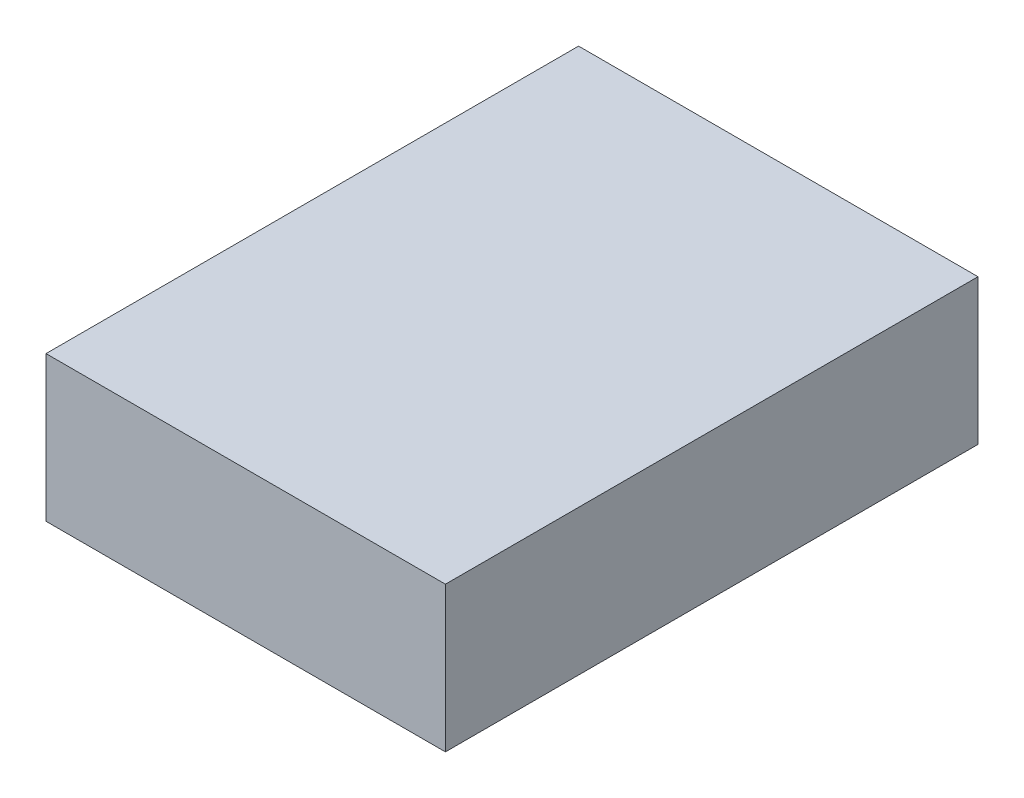
ISO-10303-21;
HEADER;
FILE_DESCRIPTION(('STEP AP214'),'2;1');
FILE_NAME('part.step','',(''),(''),'','','');
FILE_SCHEMA(('AUTOMOTIVE_DESIGN { 1 0 10303 214 1 1 1 1 }'));
ENDSEC;
DATA;
#1=APPLICATION_CONTEXT('core data for automotive mechanical design processes');
#2=APPLICATION_PROTOCOL_DEFINITION('international standard','automotive_design',2000,#1);
#3=PRODUCT_CONTEXT('',#1,'mechanical');
#4=PRODUCT('Part','Part','',(#3));
#5=PRODUCT_RELATED_PRODUCT_CATEGORY('part','',(#4));
#6=PRODUCT_DEFINITION_FORMATION('','',#4);
#7=PRODUCT_DEFINITION_CONTEXT('part definition',#1,'design');
#8=PRODUCT_DEFINITION('design','',#6,#7);
#9=PRODUCT_DEFINITION_SHAPE('','',#8);
#10=(LENGTH_UNIT() NAMED_UNIT(*) SI_UNIT(.MILLI.,.METRE.));
#11=(NAMED_UNIT(*) PLANE_ANGLE_UNIT() SI_UNIT($,.RADIAN.));
#12=(NAMED_UNIT(*) SI_UNIT($,.STERADIAN.) SOLID_ANGLE_UNIT());
#13=UNCERTAINTY_MEASURE_WITH_UNIT(LENGTH_MEASURE(1.E-05),#10,'distance_accuracy_value','');
#14=(GEOMETRIC_REPRESENTATION_CONTEXT(3) GLOBAL_UNCERTAINTY_ASSIGNED_CONTEXT((#13)) GLOBAL_UNIT_ASSIGNED_CONTEXT((#10,
#11,#12)) REPRESENTATION_CONTEXT('',''));
#15=CARTESIAN_POINT('',(0.,0.,0.));
#16=DIRECTION('',(0.,0.,1.));
#17=DIRECTION('',(1.,0.,0.));
#18=AXIS2_PLACEMENT_3D('',#15,#16,#17);
#19=CARTESIAN_POINT('',(0.,19.05,0.));
#20=DIRECTION('',(1.,0.,0.));
#21=DIRECTION('',(0.,0.,-1.));
#22=AXIS2_PLACEMENT_3D('',#19,#20,#21);
#23=PLANE('',#22);
#24=DIRECTION('',(0.,0.,1.));
#25=VECTOR('',#24,1.);
#26=CARTESIAN_POINT('',(0.,0.,0.));
#27=LINE('',#26,#25);
#28=CARTESIAN_POINT('',(0.,0.,-69.85));
#29=VERTEX_POINT('',#28);
#30=CARTESIAN_POINT('',(0.,0.,0.));
#31=VERTEX_POINT('',#30);
#32=EDGE_CURVE('E101',#29,#31,#27,.T.);
#33=ORIENTED_EDGE('',*,*,#32,.T.);
#34=DIRECTION('',(0.,-1.,0.));
#35=VECTOR('',#34,1.);
#36=CARTESIAN_POINT('',(0.,19.05,0.));
#37=LINE('',#36,#35);
#38=CARTESIAN_POINT('',(0.,19.05,0.));
#39=VERTEX_POINT('',#38);
#40=EDGE_CURVE('E11',#39,#31,#37,.T.);
#41=ORIENTED_EDGE('',*,*,#40,.F.);
#42=DIRECTION('',(0.,0.,1.));
#43=VECTOR('',#42,1.);
#44=CARTESIAN_POINT('',(0.,19.05,0.));
#45=LINE('',#44,#43);
#46=CARTESIAN_POINT('',(0.,19.05,-69.85));
#47=VERTEX_POINT('',#46);
#48=EDGE_CURVE('E89',#47,#39,#45,.T.);
#49=ORIENTED_EDGE('',*,*,#48,.F.);
#50=DIRECTION('',(0.,-1.,0.));
#51=VECTOR('',#50,1.);
#52=CARTESIAN_POINT('',(0.,19.05,-69.85));
#53=LINE('',#52,#51);
#54=EDGE_CURVE('E97',#47,#29,#53,.T.);
#55=ORIENTED_EDGE('',*,*,#54,.T.);
#56=EDGE_LOOP('',(#33,#41,#49,#55));
#57=FACE_BOUND('',#56,.T.);
#58=ADVANCED_FACE('F38',(#57),#23,.F.);
#59=CARTESIAN_POINT('',(0.,19.05,0.));
#60=DIRECTION('',(0.,0.,-1.));
#61=DIRECTION('',(-1.,0.,0.));
#62=AXIS2_PLACEMENT_3D('',#59,#60,#61);
#63=PLANE('',#62);
#64=DIRECTION('',(1.,0.,0.));
#65=VECTOR('',#64,1.);
#66=CARTESIAN_POINT('',(0.,0.,0.));
#67=LINE('',#66,#65);
#68=CARTESIAN_POINT('',(52.3875,0.,0.));
#69=VERTEX_POINT('',#68);
#70=EDGE_CURVE('E93',#31,#69,#67,.T.);
#71=ORIENTED_EDGE('',*,*,#70,.T.);
#72=DIRECTION('',(0.,-1.,0.));
#73=VECTOR('',#72,1.);
#74=CARTESIAN_POINT('',(52.3875,19.05,0.));
#75=LINE('',#74,#73);
#76=CARTESIAN_POINT('',(52.3875,19.05,0.));
#77=VERTEX_POINT('',#76);
#78=EDGE_CURVE('E46',#77,#69,#75,.T.);
#79=ORIENTED_EDGE('',*,*,#78,.F.);
#80=DIRECTION('',(1.,0.,0.));
#81=VECTOR('',#80,1.);
#82=CARTESIAN_POINT('',(0.,19.05,0.));
#83=LINE('',#82,#81);
#84=EDGE_CURVE('E84',#39,#77,#83,.T.);
#85=ORIENTED_EDGE('',*,*,#84,.F.);
#86=ORIENTED_EDGE('',*,*,#40,.T.);
#87=EDGE_LOOP('',(#71,#79,#85,#86));
#88=FACE_BOUND('',#87,.T.);
#89=ADVANCED_FACE('F92',(#88),#63,.F.);
#90=CARTESIAN_POINT('',(52.3875,19.05,0.));
#91=DIRECTION('',(-1.,0.,0.));
#92=DIRECTION('',(0.,0.,1.));
#93=AXIS2_PLACEMENT_3D('',#90,#91,#92);
#94=PLANE('',#93);
#95=DIRECTION('',(0.,0.,-1.));
#96=VECTOR('',#95,1.);
#97=CARTESIAN_POINT('',(52.3875,0.,0.));
#98=LINE('',#97,#96);
#99=CARTESIAN_POINT('',(52.3875,0.,-69.85));
#100=VERTEX_POINT('',#99);
#101=EDGE_CURVE('E71',#69,#100,#98,.T.);
#102=ORIENTED_EDGE('',*,*,#101,.T.);
#103=DIRECTION('',(0.,-1.,0.));
#104=VECTOR('',#103,1.);
#105=CARTESIAN_POINT('',(52.3875,19.05,-69.85));
#106=LINE('',#105,#104);
#107=CARTESIAN_POINT('',(52.3875,19.05,-69.85));
#108=VERTEX_POINT('',#107);
#109=EDGE_CURVE('E94',#108,#100,#106,.T.);
#110=ORIENTED_EDGE('',*,*,#109,.F.);
#111=DIRECTION('',(0.,0.,-1.));
#112=VECTOR('',#111,1.);
#113=CARTESIAN_POINT('',(52.3875,19.05,0.));
#114=LINE('',#113,#112);
#115=EDGE_CURVE('E87',#77,#108,#114,.T.);
#116=ORIENTED_EDGE('',*,*,#115,.F.);
#117=ORIENTED_EDGE('',*,*,#78,.T.);
#118=EDGE_LOOP('',(#102,#110,#116,#117));
#119=FACE_BOUND('',#118,.T.);
#120=ADVANCED_FACE('F95',(#119),#94,.F.);
#121=CARTESIAN_POINT('',(0.,19.05,-69.85));
#122=DIRECTION('',(0.,0.,1.));
#123=DIRECTION('',(1.,0.,0.));
#124=AXIS2_PLACEMENT_3D('',#121,#122,#123);
#125=PLANE('',#124);
#126=DIRECTION('',(-1.,0.,0.));
#127=VECTOR('',#126,1.);
#128=CARTESIAN_POINT('',(0.,0.,-69.85));
#129=LINE('',#128,#127);
#130=EDGE_CURVE('E77',#100,#29,#129,.T.);
#131=ORIENTED_EDGE('',*,*,#130,.T.);
#132=ORIENTED_EDGE('',*,*,#54,.F.);
#133=DIRECTION('',(-1.,0.,0.));
#134=VECTOR('',#133,1.);
#135=CARTESIAN_POINT('',(0.,19.05,-69.85));
#136=LINE('',#135,#134);
#137=EDGE_CURVE('E54',#108,#47,#136,.T.);
#138=ORIENTED_EDGE('',*,*,#137,.F.);
#139=ORIENTED_EDGE('',*,*,#109,.T.);
#140=EDGE_LOOP('',(#131,#132,#138,#139));
#141=FACE_BOUND('',#140,.T.);
#142=ADVANCED_FACE('F108',(#141),#125,.F.);
#143=CARTESIAN_POINT('',(0.,19.05,0.));
#144=DIRECTION('',(0.,-1.,0.));
#145=DIRECTION('',(0.,0.,-1.));
#146=AXIS2_PLACEMENT_3D('',#143,#144,#145);
#147=PLANE('',#146);
#148=ORIENTED_EDGE('',*,*,#48,.T.);
#149=ORIENTED_EDGE('',*,*,#84,.T.);
#150=ORIENTED_EDGE('',*,*,#115,.T.);
#151=ORIENTED_EDGE('',*,*,#137,.T.);
#152=EDGE_LOOP('',(#148,#149,#150,#151));
#153=FACE_BOUND('',#152,.T.);
#154=ADVANCED_FACE('F85',(#153),#147,.F.);
#155=CARTESIAN_POINT('',(0.,0.,0.));
#156=DIRECTION('',(0.,-1.,0.));
#157=DIRECTION('',(0.,0.,-1.));
#158=AXIS2_PLACEMENT_3D('',#155,#156,#157);
#159=PLANE('',#158);
#160=ORIENTED_EDGE('',*,*,#32,.F.);
#161=ORIENTED_EDGE('',*,*,#130,.F.);
#162=ORIENTED_EDGE('',*,*,#101,.F.);
#163=ORIENTED_EDGE('',*,*,#70,.F.);
#164=EDGE_LOOP('',(#160,#161,#162,#163));
#165=FACE_BOUND('',#164,.T.);
#166=ADVANCED_FACE('F111',(#165),#159,.T.);
#167=CLOSED_SHELL('',(#58,#89,#120,#142,#154,#166));
#168=MANIFOLD_SOLID_BREP('B2',#167);
#169=ADVANCED_BREP_SHAPE_REPRESENTATION('',(#18,#168),#14);
#170=SHAPE_DEFINITION_REPRESENTATION(#9,#169);
ENDSEC;
END-ISO-10303-21;
